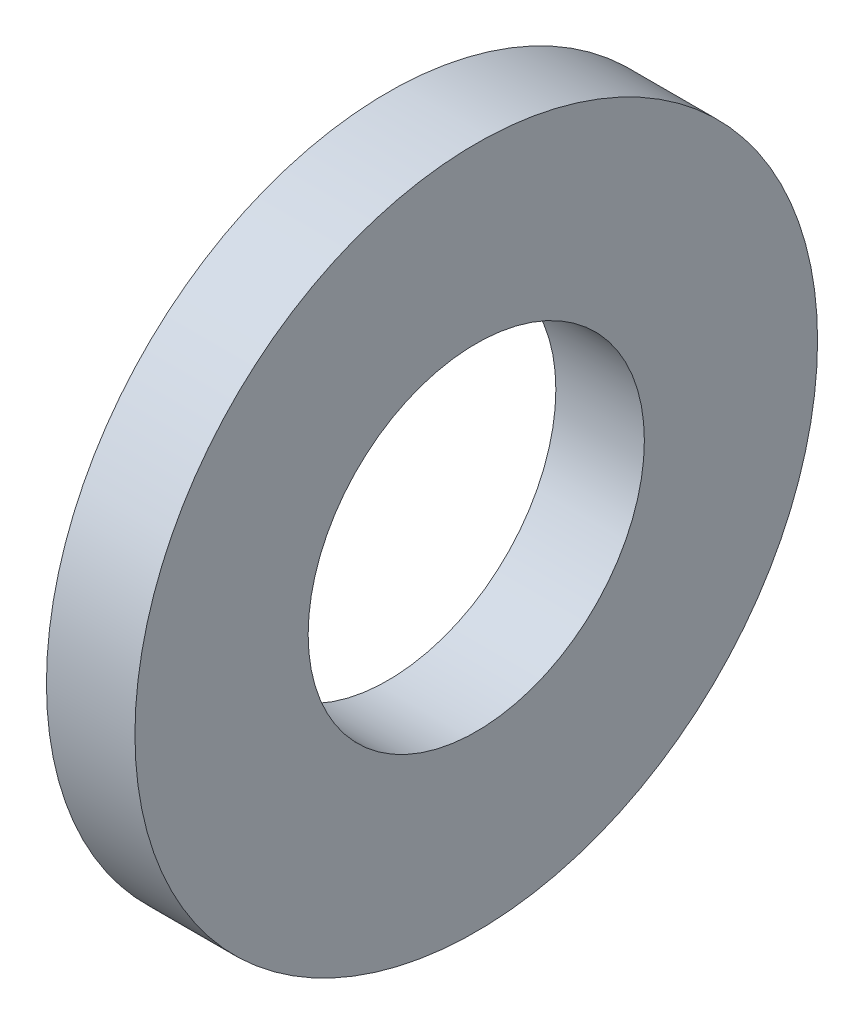
ISO-10303-21;
HEADER;
FILE_DESCRIPTION(('STEP AP214'),'2;1');
FILE_NAME('part.step','',(''),(''),'','','');
FILE_SCHEMA(('AUTOMOTIVE_DESIGN { 1 0 10303 214 1 1 1 1 }'));
ENDSEC;
DATA;
#1=APPLICATION_CONTEXT('core data for automotive mechanical design processes');
#2=APPLICATION_PROTOCOL_DEFINITION('international standard','automotive_design',2000,#1);
#3=PRODUCT_CONTEXT('',#1,'mechanical');
#4=PRODUCT('Part','Part','',(#3));
#5=PRODUCT_RELATED_PRODUCT_CATEGORY('part','',(#4));
#6=PRODUCT_DEFINITION_FORMATION('','',#4);
#7=PRODUCT_DEFINITION_CONTEXT('part definition',#1,'design');
#8=PRODUCT_DEFINITION('design','',#6,#7);
#9=PRODUCT_DEFINITION_SHAPE('','',#8);
#10=(LENGTH_UNIT() NAMED_UNIT(*) SI_UNIT(.MILLI.,.METRE.));
#11=(NAMED_UNIT(*) PLANE_ANGLE_UNIT() SI_UNIT($,.RADIAN.));
#12=(NAMED_UNIT(*) SI_UNIT($,.STERADIAN.) SOLID_ANGLE_UNIT());
#13=UNCERTAINTY_MEASURE_WITH_UNIT(LENGTH_MEASURE(1.E-05),#10,'distance_accuracy_value','');
#14=(GEOMETRIC_REPRESENTATION_CONTEXT(3) GLOBAL_UNCERTAINTY_ASSIGNED_CONTEXT((#13)) GLOBAL_UNIT_ASSIGNED_CONTEXT((#10,
#11,#12)) REPRESENTATION_CONTEXT('',''));
#15=CARTESIAN_POINT('',(0.,0.,0.));
#16=DIRECTION('',(0.,0.,1.));
#17=DIRECTION('',(1.,0.,0.));
#18=AXIS2_PLACEMENT_3D('',#15,#16,#17);
#19=CARTESIAN_POINT('',(4.4196,0.,0.));
#20=DIRECTION('',(1.,0.,0.));
#21=DIRECTION('',(0.,0.,-1.));
#22=AXIS2_PLACEMENT_3D('',#19,#20,#21);
#23=PLANE('',#22);
#24=CARTESIAN_POINT('',(4.4196,0.,0.));
#25=DIRECTION('',(1.,0.,0.));
#26=DIRECTION('',(0.,0.,-1.));
#27=AXIS2_PLACEMENT_3D('',#24,#25,#26);
#28=CIRCLE('',#27,17.0434);
#29=CARTESIAN_POINT('',(4.4196,0.,-17.0434));
#30=VERTEX_POINT('',#29);
#31=EDGE_CURVE('E10',#30,#30,#28,.T.);
#32=ORIENTED_EDGE('',*,*,#31,.T.);
#33=EDGE_LOOP('',(#32));
#34=FACE_BOUND('',#33,.T.);
#35=CARTESIAN_POINT('',(4.4196,0.,0.));
#36=DIRECTION('',(1.,0.,0.));
#37=DIRECTION('',(0.,0.,-1.));
#38=AXIS2_PLACEMENT_3D('',#35,#36,#37);
#39=CIRCLE('',#38,8.3947);
#40=CARTESIAN_POINT('',(4.4196,0.,-8.3947));
#41=VERTEX_POINT('',#40);
#42=EDGE_CURVE('E43',#41,#41,#39,.T.);
#43=ORIENTED_EDGE('',*,*,#42,.F.);
#44=EDGE_LOOP('',(#43));
#45=FACE_BOUND('',#44,.T.);
#46=ADVANCED_FACE('F32',(#34,#45),#23,.T.);
#47=CARTESIAN_POINT('',(0.,0.,0.));
#48=DIRECTION('',(1.,0.,0.));
#49=DIRECTION('',(0.,0.,-1.));
#50=AXIS2_PLACEMENT_3D('',#47,#48,#49);
#51=PLANE('',#50);
#52=CARTESIAN_POINT('',(0.,0.,0.));
#53=DIRECTION('',(1.,0.,0.));
#54=DIRECTION('',(0.,0.,-1.));
#55=AXIS2_PLACEMENT_3D('',#52,#53,#54);
#56=CIRCLE('',#55,17.0434);
#57=CARTESIAN_POINT('',(0.,0.,-17.0434));
#58=VERTEX_POINT('',#57);
#59=EDGE_CURVE('E36',#58,#58,#56,.T.);
#60=ORIENTED_EDGE('',*,*,#59,.F.);
#61=EDGE_LOOP('',(#60));
#62=FACE_BOUND('',#61,.T.);
#63=CARTESIAN_POINT('',(0.,0.,0.));
#64=DIRECTION('',(1.,0.,0.));
#65=DIRECTION('',(0.,0.,-1.));
#66=AXIS2_PLACEMENT_3D('',#63,#64,#65);
#67=CIRCLE('',#66,8.3947);
#68=CARTESIAN_POINT('',(0.,0.,-8.3947));
#69=VERTEX_POINT('',#68);
#70=EDGE_CURVE('E45',#69,#69,#67,.T.);
#71=ORIENTED_EDGE('',*,*,#70,.T.);
#72=EDGE_LOOP('',(#71));
#73=FACE_BOUND('',#72,.T.);
#74=ADVANCED_FACE('F55',(#62,#73),#51,.F.);
#75=CARTESIAN_POINT('',(4.4196,0.,0.));
#76=DIRECTION('',(-1.,0.,0.));
#77=DIRECTION('',(0.,0.,1.));
#78=AXIS2_PLACEMENT_3D('',#75,#76,#77);
#79=CYLINDRICAL_SURFACE('',#78,17.0434);
#80=ORIENTED_EDGE('',*,*,#31,.F.);
#81=EDGE_LOOP('',(#80));
#82=FACE_BOUND('',#81,.T.);
#83=ORIENTED_EDGE('',*,*,#59,.T.);
#84=EDGE_LOOP('',(#83));
#85=FACE_BOUND('',#84,.T.);
#86=ADVANCED_FACE('F34',(#82,#85),#79,.T.);
#87=CARTESIAN_POINT('',(4.4196,0.,0.));
#88=DIRECTION('',(-1.,0.,0.));
#89=DIRECTION('',(0.,0.,1.));
#90=AXIS2_PLACEMENT_3D('',#87,#88,#89);
#91=CYLINDRICAL_SURFACE('',#90,8.3947);
#92=ORIENTED_EDGE('',*,*,#42,.T.);
#93=EDGE_LOOP('',(#92));
#94=FACE_BOUND('',#93,.T.);
#95=ORIENTED_EDGE('',*,*,#70,.F.);
#96=EDGE_LOOP('',(#95));
#97=FACE_BOUND('',#96,.T.);
#98=ADVANCED_FACE('F51',(#94,#97),#91,.F.);
#99=CLOSED_SHELL('',(#46,#74,#86,#98));
#100=MANIFOLD_SOLID_BREP('B2',#99);
#101=ADVANCED_BREP_SHAPE_REPRESENTATION('',(#18,#100),#14);
#102=SHAPE_DEFINITION_REPRESENTATION(#9,#101);
ENDSEC;
END-ISO-10303-21;
